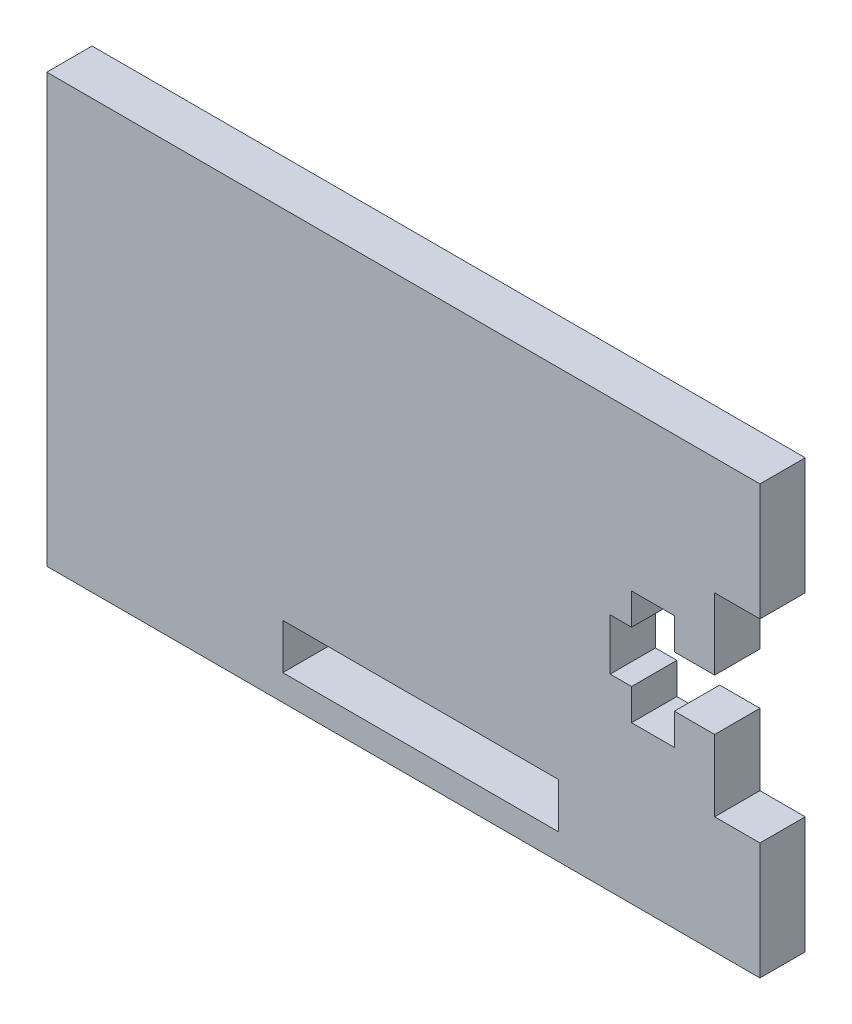
ISO-10303-21;
HEADER;
FILE_DESCRIPTION(('STEP AP214'),'2;1');
FILE_NAME('part.step','',(''),(''),'','','');
FILE_SCHEMA(('AUTOMOTIVE_DESIGN { 1 0 10303 214 1 1 1 1 }'));
ENDSEC;
DATA;
#1=APPLICATION_CONTEXT('core data for automotive mechanical design processes');
#2=APPLICATION_PROTOCOL_DEFINITION('international standard','automotive_design',2000,#1);
#3=PRODUCT_CONTEXT('',#1,'mechanical');
#4=PRODUCT('Part','Part','',(#3));
#5=PRODUCT_RELATED_PRODUCT_CATEGORY('part','',(#4));
#6=PRODUCT_DEFINITION_FORMATION('','',#4);
#7=PRODUCT_DEFINITION_CONTEXT('part definition',#1,'design');
#8=PRODUCT_DEFINITION('design','',#6,#7);
#9=PRODUCT_DEFINITION_SHAPE('','',#8);
#10=(LENGTH_UNIT() NAMED_UNIT(*) SI_UNIT(.MILLI.,.METRE.));
#11=(NAMED_UNIT(*) PLANE_ANGLE_UNIT() SI_UNIT($,.RADIAN.));
#12=(NAMED_UNIT(*) SI_UNIT($,.STERADIAN.) SOLID_ANGLE_UNIT());
#13=UNCERTAINTY_MEASURE_WITH_UNIT(LENGTH_MEASURE(1.E-05),#10,'distance_accuracy_value','');
#14=(GEOMETRIC_REPRESENTATION_CONTEXT(3) GLOBAL_UNCERTAINTY_ASSIGNED_CONTEXT((#13)) GLOBAL_UNIT_ASSIGNED_CONTEXT((#10,
#11,#12)) REPRESENTATION_CONTEXT('',''));
#15=CARTESIAN_POINT('',(0.,0.,0.));
#16=DIRECTION('',(0.,0.,1.));
#17=DIRECTION('',(1.,0.,0.));
#18=AXIS2_PLACEMENT_3D('',#15,#16,#17);
#19=CARTESIAN_POINT('',(0.,0.,3.175));
#20=DIRECTION('',(0.,0.,1.));
#21=DIRECTION('',(1.,0.,0.));
#22=AXIS2_PLACEMENT_3D('',#19,#20,#21);
#23=PLANE('',#22);
#24=DIRECTION('',(0.,-1.,0.));
#25=VECTOR('',#24,1.);
#26=CARTESIAN_POINT('',(-96.9112582031601,47.7807662428294,3.175));
#27=LINE('',#26,#25);
#28=CARTESIAN_POINT('',(-96.9112582031601,47.7807662428294,3.175));
#29=VERTEX_POINT('',#28);
#30=CARTESIAN_POINT('',(-96.9112582031601,17.7807662428356,3.175));
#31=VERTEX_POINT('',#30);
#32=EDGE_CURVE('E230',#29,#31,#27,.T.);
#33=ORIENTED_EDGE('',*,*,#32,.T.);
#34=DIRECTION('',(1.,0.,0.));
#35=VECTOR('',#34,1.);
#36=CARTESIAN_POINT('',(-96.9112582031601,17.7807662428356,3.175));
#37=LINE('',#36,#35);
#38=CARTESIAN_POINT('',(-46.9112582031603,17.7807662428352,3.175));
#39=VERTEX_POINT('',#38);
#40=EDGE_CURVE('E233',#31,#39,#37,.T.);
#41=ORIENTED_EDGE('',*,*,#40,.T.);
#42=DIRECTION('',(0.,1.,0.));
#43=VECTOR('',#42,1.);
#44=CARTESIAN_POINT('',(-46.9112582031603,25.9807662428354,3.175));
#45=LINE('',#44,#43);
#46=CARTESIAN_POINT('',(-46.9112582031603,25.9807662428354,3.175));
#47=VERTEX_POINT('',#46);
#48=EDGE_CURVE('E236',#39,#47,#45,.T.);
#49=ORIENTED_EDGE('',*,*,#48,.T.);
#50=DIRECTION('',(-1.,0.,0.));
#51=VECTOR('',#50,1.);
#52=CARTESIAN_POINT('',(-46.9112582031603,25.9807662428354,3.175));
#53=LINE('',#52,#51);
#54=CARTESIAN_POINT('',(-50.0862582031601,25.9807662428354,3.175));
#55=VERTEX_POINT('',#54);
#56=EDGE_CURVE('E238',#47,#55,#53,.T.);
#57=ORIENTED_EDGE('',*,*,#56,.T.);
#58=DIRECTION('',(0.,1.,0.));
#59=VECTOR('',#58,1.);
#60=CARTESIAN_POINT('',(-50.0862582031601,25.9807662428354,3.175));
#61=LINE('',#60,#59);
#62=CARTESIAN_POINT('',(-50.0862582031601,30.9807662428354,3.175));
#63=VERTEX_POINT('',#62);
#64=EDGE_CURVE('E240',#55,#63,#61,.T.);
#65=ORIENTED_EDGE('',*,*,#64,.T.);
#66=DIRECTION('',(-1.,0.,0.));
#67=VECTOR('',#66,1.);
#68=CARTESIAN_POINT('',(-50.0862582031601,30.9807662428354,3.175));
#69=LINE('',#68,#67);
#70=CARTESIAN_POINT('',(-52.9112582031601,30.9807662428354,3.175));
#71=VERTEX_POINT('',#70);
#72=EDGE_CURVE('E242',#63,#71,#69,.T.);
#73=ORIENTED_EDGE('',*,*,#72,.T.);
#74=DIRECTION('',(0.,-1.,0.));
#75=VECTOR('',#74,1.);
#76=CARTESIAN_POINT('',(-52.9112582031601,30.9807662428354,3.175));
#77=LINE('',#76,#75);
#78=CARTESIAN_POINT('',(-52.9112582031601,28.7807662428356,3.175));
#79=VERTEX_POINT('',#78);
#80=EDGE_CURVE('E244',#71,#79,#77,.T.);
#81=ORIENTED_EDGE('',*,*,#80,.T.);
#82=DIRECTION('',(-1.,0.,0.));
#83=VECTOR('',#82,1.);
#84=CARTESIAN_POINT('',(-52.9112582031601,28.7807662428356,3.175));
#85=LINE('',#84,#83);
#86=CARTESIAN_POINT('',(-55.9112582031601,28.7807662428355,3.175));
#87=VERTEX_POINT('',#86);
#88=EDGE_CURVE('E246',#79,#87,#85,.T.);
#89=ORIENTED_EDGE('',*,*,#88,.T.);
#90=DIRECTION('',(0.,1.,0.));
#91=VECTOR('',#90,1.);
#92=CARTESIAN_POINT('',(-55.9112582031601,28.7807662428355,3.175));
#93=LINE('',#92,#91);
#94=CARTESIAN_POINT('',(-55.9112582031601,30.9807662428356,3.175));
#95=VERTEX_POINT('',#94);
#96=EDGE_CURVE('E248',#87,#95,#93,.T.);
#97=ORIENTED_EDGE('',*,*,#96,.T.);
#98=DIRECTION('',(-1.,0.,0.));
#99=VECTOR('',#98,1.);
#100=CARTESIAN_POINT('',(-55.9112582031601,30.9807662428356,3.175));
#101=LINE('',#100,#99);
#102=CARTESIAN_POINT('',(-57.4112582031601,30.9807662428356,3.175));
#103=VERTEX_POINT('',#102);
#104=EDGE_CURVE('E250',#95,#103,#101,.T.);
#105=ORIENTED_EDGE('',*,*,#104,.T.);
#106=DIRECTION('',(0.,1.,0.));
#107=VECTOR('',#106,1.);
#108=CARTESIAN_POINT('',(-57.4112582031601,34.5807662428356,3.175));
#109=LINE('',#108,#107);
#110=CARTESIAN_POINT('',(-57.4112582031601,34.5807662428356,3.175));
#111=VERTEX_POINT('',#110);
#112=EDGE_CURVE('E252',#103,#111,#109,.T.);
#113=ORIENTED_EDGE('',*,*,#112,.T.);
#114=DIRECTION('',(1.,0.,0.));
#115=VECTOR('',#114,1.);
#116=CARTESIAN_POINT('',(-55.9112582031601,34.5807662428356,3.175));
#117=LINE('',#116,#115);
#118=CARTESIAN_POINT('',(-55.9112582031601,34.5807662428356,3.175));
#119=VERTEX_POINT('',#118);
#120=EDGE_CURVE('E254',#111,#119,#117,.T.);
#121=ORIENTED_EDGE('',*,*,#120,.T.);
#122=DIRECTION('',(0.,1.,0.));
#123=VECTOR('',#122,1.);
#124=CARTESIAN_POINT('',(-55.9112582031601,36.7807662428356,3.175));
#125=LINE('',#124,#123);
#126=CARTESIAN_POINT('',(-55.9112582031601,36.7807662428356,3.175));
#127=VERTEX_POINT('',#126);
#128=EDGE_CURVE('E256',#119,#127,#125,.T.);
#129=ORIENTED_EDGE('',*,*,#128,.T.);
#130=DIRECTION('',(1.,0.,0.));
#131=VECTOR('',#130,1.);
#132=CARTESIAN_POINT('',(-52.9112582031601,36.7807662428356,3.175));
#133=LINE('',#132,#131);
#134=CARTESIAN_POINT('',(-52.9112582031601,36.7807662428356,3.175));
#135=VERTEX_POINT('',#134);
#136=EDGE_CURVE('E258',#127,#135,#133,.T.);
#137=ORIENTED_EDGE('',*,*,#136,.T.);
#138=DIRECTION('',(0.,-1.,0.));
#139=VECTOR('',#138,1.);
#140=CARTESIAN_POINT('',(-52.9112582031601,34.5807662428356,3.175));
#141=LINE('',#140,#139);
#142=CARTESIAN_POINT('',(-52.9112582031601,34.5807662428356,3.175));
#143=VERTEX_POINT('',#142);
#144=EDGE_CURVE('E260',#135,#143,#141,.T.);
#145=ORIENTED_EDGE('',*,*,#144,.T.);
#146=DIRECTION('',(1.,0.,0.));
#147=VECTOR('',#146,1.);
#148=CARTESIAN_POINT('',(-50.0862582031601,34.5807662428356,3.175));
#149=LINE('',#148,#147);
#150=CARTESIAN_POINT('',(-50.0862582031601,34.5807662428356,3.175));
#151=VERTEX_POINT('',#150);
#152=EDGE_CURVE('E262',#143,#151,#149,.T.);
#153=ORIENTED_EDGE('',*,*,#152,.T.);
#154=DIRECTION('',(0.,1.,0.));
#155=VECTOR('',#154,1.);
#156=CARTESIAN_POINT('',(-50.0862582031601,39.5807662428356,3.175));
#157=LINE('',#156,#155);
#158=CARTESIAN_POINT('',(-50.0862582031601,39.5807662428356,3.175));
#159=VERTEX_POINT('',#158);
#160=EDGE_CURVE('E264',#151,#159,#157,.T.);
#161=ORIENTED_EDGE('',*,*,#160,.T.);
#162=DIRECTION('',(1.,0.,0.));
#163=VECTOR('',#162,1.);
#164=CARTESIAN_POINT('',(-46.9112582031603,39.5807662428356,3.175));
#165=LINE('',#164,#163);
#166=CARTESIAN_POINT('',(-46.9112582031603,39.5807662428356,3.175));
#167=VERTEX_POINT('',#166);
#168=EDGE_CURVE('E266',#159,#167,#165,.T.);
#169=ORIENTED_EDGE('',*,*,#168,.T.);
#170=DIRECTION('',(0.,1.,0.));
#171=VECTOR('',#170,1.);
#172=CARTESIAN_POINT('',(-46.9112582031603,47.7807662428294,3.175));
#173=LINE('',#172,#171);
#174=CARTESIAN_POINT('',(-46.9112582031603,47.7807662428294,3.175));
#175=VERTEX_POINT('',#174);
#176=EDGE_CURVE('E268',#167,#175,#173,.T.);
#177=ORIENTED_EDGE('',*,*,#176,.T.);
#178=DIRECTION('',(-1.,0.,0.));
#179=VECTOR('',#178,1.);
#180=CARTESIAN_POINT('',(-96.9112582031601,47.7807662428294,3.175));
#181=LINE('',#180,#179);
#182=EDGE_CURVE('E270',#175,#29,#181,.T.);
#183=ORIENTED_EDGE('',*,*,#182,.T.);
#184=EDGE_LOOP('',(#33,#41,#49,#57,#65,#73,#81,#89,#97,#105,#113,#121,#129,#137,#145,#153,#161,
#169,#177,#183));
#185=FACE_BOUND('',#184,.T.);
#186=DIRECTION('',(-1.,0.,0.));
#187=VECTOR('',#186,1.);
#188=CARTESIAN_POINT('',(-61.0250937078409,22.7702012369483,3.175));
#189=LINE('',#188,#187);
#190=CARTESIAN_POINT('',(-61.0250937078409,22.7702012369483,3.175));
#191=VERTEX_POINT('',#190);
#192=CARTESIAN_POINT('',(-80.3635974839928,22.7702012369483,3.175));
#193=VERTEX_POINT('',#192);
#194=EDGE_CURVE('E202',#191,#193,#189,.T.);
#195=ORIENTED_EDGE('',*,*,#194,.F.);
#196=DIRECTION('',(0.,1.,0.));
#197=VECTOR('',#196,1.);
#198=CARTESIAN_POINT('',(-61.0250937078409,19.5952012369483,3.175));
#199=LINE('',#198,#197);
#200=CARTESIAN_POINT('',(-61.0250937078409,19.5952012369483,3.175));
#201=VERTEX_POINT('',#200);
#202=EDGE_CURVE('E194',#201,#191,#199,.T.);
#203=ORIENTED_EDGE('',*,*,#202,.F.);
#204=DIRECTION('',(1.,0.,0.));
#205=VECTOR('',#204,1.);
#206=CARTESIAN_POINT('',(-61.0250937078409,19.5952012369483,3.175));
#207=LINE('',#206,#205);
#208=CARTESIAN_POINT('',(-80.3635974839928,19.5952012369483,3.175));
#209=VERTEX_POINT('',#208);
#210=EDGE_CURVE('E216',#209,#201,#207,.T.);
#211=ORIENTED_EDGE('',*,*,#210,.F.);
#212=DIRECTION('',(0.,-1.,0.));
#213=VECTOR('',#212,1.);
#214=CARTESIAN_POINT('',(-80.3635974839928,19.5952012369483,3.175));
#215=LINE('',#214,#213);
#216=EDGE_CURVE('E214',#193,#209,#215,.T.);
#217=ORIENTED_EDGE('',*,*,#216,.F.);
#218=EDGE_LOOP('',(#195,#203,#211,#217));
#219=FACE_BOUND('',#218,.T.);
#220=ADVANCED_FACE('F33',(#185,#219),#23,.T.);
#221=CARTESIAN_POINT('',(0.,0.,0.));
#222=DIRECTION('',(0.,0.,1.));
#223=DIRECTION('',(1.,0.,0.));
#224=AXIS2_PLACEMENT_3D('',#221,#222,#223);
#225=PLANE('',#224);
#226=DIRECTION('',(0.,-1.,0.));
#227=VECTOR('',#226,1.);
#228=CARTESIAN_POINT('',(-96.9112582031601,47.7807662428294,0.));
#229=LINE('',#228,#227);
#230=CARTESIAN_POINT('',(-96.9112582031601,47.7807662428294,0.));
#231=VERTEX_POINT('',#230);
#232=CARTESIAN_POINT('',(-96.9112582031601,17.7807662428356,0.));
#233=VERTEX_POINT('',#232);
#234=EDGE_CURVE('E210',#231,#233,#229,.T.);
#235=ORIENTED_EDGE('',*,*,#234,.F.);
#236=DIRECTION('',(-1.,0.,0.));
#237=VECTOR('',#236,1.);
#238=CARTESIAN_POINT('',(-96.9112582031601,47.7807662428294,0.));
#239=LINE('',#238,#237);
#240=CARTESIAN_POINT('',(-46.9112582031603,47.7807662428294,0.));
#241=VERTEX_POINT('',#240);
#242=EDGE_CURVE('E234',#241,#231,#239,.T.);
#243=ORIENTED_EDGE('',*,*,#242,.F.);
#244=DIRECTION('',(0.,1.,0.));
#245=VECTOR('',#244,1.);
#246=CARTESIAN_POINT('',(-46.9112582031603,47.7807662428294,0.));
#247=LINE('',#246,#245);
#248=CARTESIAN_POINT('',(-46.9112582031603,39.5807662428356,0.));
#249=VERTEX_POINT('',#248);
#250=EDGE_CURVE('E309',#249,#241,#247,.T.);
#251=ORIENTED_EDGE('',*,*,#250,.F.);
#252=DIRECTION('',(1.,0.,0.));
#253=VECTOR('',#252,1.);
#254=CARTESIAN_POINT('',(-46.9112582031603,39.5807662428356,0.));
#255=LINE('',#254,#253);
#256=CARTESIAN_POINT('',(-50.0862582031601,39.5807662428356,0.));
#257=VERTEX_POINT('',#256);
#258=EDGE_CURVE('E307',#257,#249,#255,.T.);
#259=ORIENTED_EDGE('',*,*,#258,.F.);
#260=DIRECTION('',(0.,1.,0.));
#261=VECTOR('',#260,1.);
#262=CARTESIAN_POINT('',(-50.0862582031601,39.5807662428356,0.));
#263=LINE('',#262,#261);
#264=CARTESIAN_POINT('',(-50.0862582031601,34.5807662428356,0.));
#265=VERTEX_POINT('',#264);
#266=EDGE_CURVE('E305',#265,#257,#263,.T.);
#267=ORIENTED_EDGE('',*,*,#266,.F.);
#268=DIRECTION('',(1.,0.,0.));
#269=VECTOR('',#268,1.);
#270=CARTESIAN_POINT('',(-50.0862582031601,34.5807662428356,0.));
#271=LINE('',#270,#269);
#272=CARTESIAN_POINT('',(-52.9112582031601,34.5807662428356,0.));
#273=VERTEX_POINT('',#272);
#274=EDGE_CURVE('E303',#273,#265,#271,.T.);
#275=ORIENTED_EDGE('',*,*,#274,.F.);
#276=DIRECTION('',(0.,-1.,0.));
#277=VECTOR('',#276,1.);
#278=CARTESIAN_POINT('',(-52.9112582031601,34.5807662428356,0.));
#279=LINE('',#278,#277);
#280=CARTESIAN_POINT('',(-52.9112582031601,36.7807662428356,0.));
#281=VERTEX_POINT('',#280);
#282=EDGE_CURVE('E301',#281,#273,#279,.T.);
#283=ORIENTED_EDGE('',*,*,#282,.F.);
#284=DIRECTION('',(1.,0.,0.));
#285=VECTOR('',#284,1.);
#286=CARTESIAN_POINT('',(-52.9112582031601,36.7807662428356,0.));
#287=LINE('',#286,#285);
#288=CARTESIAN_POINT('',(-55.9112582031601,36.7807662428356,0.));
#289=VERTEX_POINT('',#288);
#290=EDGE_CURVE('E299',#289,#281,#287,.T.);
#291=ORIENTED_EDGE('',*,*,#290,.F.);
#292=DIRECTION('',(0.,1.,0.));
#293=VECTOR('',#292,1.);
#294=CARTESIAN_POINT('',(-55.9112582031601,36.7807662428356,0.));
#295=LINE('',#294,#293);
#296=CARTESIAN_POINT('',(-55.9112582031601,34.5807662428356,0.));
#297=VERTEX_POINT('',#296);
#298=EDGE_CURVE('E297',#297,#289,#295,.T.);
#299=ORIENTED_EDGE('',*,*,#298,.F.);
#300=DIRECTION('',(1.,0.,0.));
#301=VECTOR('',#300,1.);
#302=CARTESIAN_POINT('',(-55.9112582031601,34.5807662428356,0.));
#303=LINE('',#302,#301);
#304=CARTESIAN_POINT('',(-57.4112582031601,34.5807662428356,0.));
#305=VERTEX_POINT('',#304);
#306=EDGE_CURVE('E295',#305,#297,#303,.T.);
#307=ORIENTED_EDGE('',*,*,#306,.F.);
#308=DIRECTION('',(0.,1.,0.));
#309=VECTOR('',#308,1.);
#310=CARTESIAN_POINT('',(-57.4112582031601,34.5807662428356,0.));
#311=LINE('',#310,#309);
#312=CARTESIAN_POINT('',(-57.4112582031601,30.9807662428356,0.));
#313=VERTEX_POINT('',#312);
#314=EDGE_CURVE('E293',#313,#305,#311,.T.);
#315=ORIENTED_EDGE('',*,*,#314,.F.);
#316=DIRECTION('',(-1.,0.,0.));
#317=VECTOR('',#316,1.);
#318=CARTESIAN_POINT('',(-55.9112582031601,30.9807662428356,0.));
#319=LINE('',#318,#317);
#320=CARTESIAN_POINT('',(-55.9112582031601,30.9807662428356,0.));
#321=VERTEX_POINT('',#320);
#322=EDGE_CURVE('E291',#321,#313,#319,.T.);
#323=ORIENTED_EDGE('',*,*,#322,.F.);
#324=DIRECTION('',(0.,1.,0.));
#325=VECTOR('',#324,1.);
#326=CARTESIAN_POINT('',(-55.9112582031601,28.7807662428355,0.));
#327=LINE('',#326,#325);
#328=CARTESIAN_POINT('',(-55.9112582031601,28.7807662428355,0.));
#329=VERTEX_POINT('',#328);
#330=EDGE_CURVE('E289',#329,#321,#327,.T.);
#331=ORIENTED_EDGE('',*,*,#330,.F.);
#332=DIRECTION('',(-1.,0.,0.));
#333=VECTOR('',#332,1.);
#334=CARTESIAN_POINT('',(-52.9112582031601,28.7807662428356,0.));
#335=LINE('',#334,#333);
#336=CARTESIAN_POINT('',(-52.9112582031601,28.7807662428356,0.));
#337=VERTEX_POINT('',#336);
#338=EDGE_CURVE('E287',#337,#329,#335,.T.);
#339=ORIENTED_EDGE('',*,*,#338,.F.);
#340=DIRECTION('',(0.,-1.,0.));
#341=VECTOR('',#340,1.);
#342=CARTESIAN_POINT('',(-52.9112582031601,30.9807662428354,0.));
#343=LINE('',#342,#341);
#344=CARTESIAN_POINT('',(-52.9112582031601,30.9807662428354,0.));
#345=VERTEX_POINT('',#344);
#346=EDGE_CURVE('E285',#345,#337,#343,.T.);
#347=ORIENTED_EDGE('',*,*,#346,.F.);
#348=DIRECTION('',(-1.,0.,0.));
#349=VECTOR('',#348,1.);
#350=CARTESIAN_POINT('',(-50.0862582031601,30.9807662428354,0.));
#351=LINE('',#350,#349);
#352=CARTESIAN_POINT('',(-50.0862582031601,30.9807662428354,0.));
#353=VERTEX_POINT('',#352);
#354=EDGE_CURVE('E283',#353,#345,#351,.T.);
#355=ORIENTED_EDGE('',*,*,#354,.F.);
#356=DIRECTION('',(0.,1.,0.));
#357=VECTOR('',#356,1.);
#358=CARTESIAN_POINT('',(-50.0862582031601,25.9807662428354,0.));
#359=LINE('',#358,#357);
#360=CARTESIAN_POINT('',(-50.0862582031601,25.9807662428354,0.));
#361=VERTEX_POINT('',#360);
#362=EDGE_CURVE('E281',#361,#353,#359,.T.);
#363=ORIENTED_EDGE('',*,*,#362,.F.);
#364=DIRECTION('',(-1.,0.,0.));
#365=VECTOR('',#364,1.);
#366=CARTESIAN_POINT('',(-46.9112582031603,25.9807662428354,0.));
#367=LINE('',#366,#365);
#368=CARTESIAN_POINT('',(-46.9112582031603,25.9807662428354,0.));
#369=VERTEX_POINT('',#368);
#370=EDGE_CURVE('E279',#369,#361,#367,.T.);
#371=ORIENTED_EDGE('',*,*,#370,.F.);
#372=DIRECTION('',(0.,1.,0.));
#373=VECTOR('',#372,1.);
#374=CARTESIAN_POINT('',(-46.9112582031603,25.9807662428354,0.));
#375=LINE('',#374,#373);
#376=CARTESIAN_POINT('',(-46.9112582031603,17.7807662428352,0.));
#377=VERTEX_POINT('',#376);
#378=EDGE_CURVE('E277',#377,#369,#375,.T.);
#379=ORIENTED_EDGE('',*,*,#378,.F.);
#380=DIRECTION('',(1.,0.,0.));
#381=VECTOR('',#380,1.);
#382=CARTESIAN_POINT('',(-96.9112582031601,17.7807662428356,0.));
#383=LINE('',#382,#381);
#384=EDGE_CURVE('E275',#233,#377,#383,.T.);
#385=ORIENTED_EDGE('',*,*,#384,.F.);
#386=EDGE_LOOP('',(#235,#243,#251,#259,#267,#275,#283,#291,#299,#307,#315,#323,#331,#339,#347,
#355,#363,#371,#379,#385));
#387=FACE_BOUND('',#386,.T.);
#388=DIRECTION('',(0.,1.,0.));
#389=VECTOR('',#388,1.);
#390=CARTESIAN_POINT('',(-61.0250937078409,19.5952012369483,0.));
#391=LINE('',#390,#389);
#392=CARTESIAN_POINT('',(-61.0250937078409,19.5952012369483,0.));
#393=VERTEX_POINT('',#392);
#394=CARTESIAN_POINT('',(-61.0250937078409,22.7702012369483,0.));
#395=VERTEX_POINT('',#394);
#396=EDGE_CURVE('E56',#393,#395,#391,.T.);
#397=ORIENTED_EDGE('',*,*,#396,.T.);
#398=DIRECTION('',(-1.,0.,0.));
#399=VECTOR('',#398,1.);
#400=CARTESIAN_POINT('',(-61.0250937078409,22.7702012369483,0.));
#401=LINE('',#400,#399);
#402=CARTESIAN_POINT('',(-80.3635974839928,22.7702012369483,0.));
#403=VERTEX_POINT('',#402);
#404=EDGE_CURVE('E209',#395,#403,#401,.T.);
#405=ORIENTED_EDGE('',*,*,#404,.T.);
#406=DIRECTION('',(0.,-1.,0.));
#407=VECTOR('',#406,1.);
#408=CARTESIAN_POINT('',(-80.3635974839928,19.5952012369483,0.));
#409=LINE('',#408,#407);
#410=CARTESIAN_POINT('',(-80.3635974839928,19.5952012369483,0.));
#411=VERTEX_POINT('',#410);
#412=EDGE_CURVE('E222',#403,#411,#409,.T.);
#413=ORIENTED_EDGE('',*,*,#412,.T.);
#414=DIRECTION('',(1.,0.,0.));
#415=VECTOR('',#414,1.);
#416=CARTESIAN_POINT('',(-61.0250937078409,19.5952012369483,0.));
#417=LINE('',#416,#415);
#418=EDGE_CURVE('E203',#411,#393,#417,.T.);
#419=ORIENTED_EDGE('',*,*,#418,.T.);
#420=EDGE_LOOP('',(#397,#405,#413,#419));
#421=FACE_BOUND('',#420,.T.);
#422=ADVANCED_FACE('F375',(#387,#421),#225,.F.);
#423=CARTESIAN_POINT('',(-96.9112582031601,47.7807662428294,3.175));
#424=DIRECTION('',(1.,0.,0.));
#425=DIRECTION('',(0.,0.,-1.));
#426=AXIS2_PLACEMENT_3D('',#423,#424,#425);
#427=PLANE('',#426);
#428=ORIENTED_EDGE('',*,*,#234,.T.);
#429=DIRECTION('',(0.,0.,-1.));
#430=VECTOR('',#429,1.);
#431=CARTESIAN_POINT('',(-96.9112582031601,17.7807662428356,3.175));
#432=LINE('',#431,#430);
#433=EDGE_CURVE('E11',#31,#233,#432,.T.);
#434=ORIENTED_EDGE('',*,*,#433,.F.);
#435=ORIENTED_EDGE('',*,*,#32,.F.);
#436=DIRECTION('',(0.,0.,-1.));
#437=VECTOR('',#436,1.);
#438=CARTESIAN_POINT('',(-96.9112582031601,47.7807662428294,3.175));
#439=LINE('',#438,#437);
#440=EDGE_CURVE('E272',#29,#231,#439,.T.);
#441=ORIENTED_EDGE('',*,*,#440,.T.);
#442=EDGE_LOOP('',(#428,#434,#435,#441));
#443=FACE_BOUND('',#442,.T.);
#444=ADVANCED_FACE('F35',(#443),#427,.F.);
#445=CARTESIAN_POINT('',(-96.9112582031601,17.7807662428356,3.175));
#446=DIRECTION('',(0.,1.,0.));
#447=DIRECTION('',(-1.,0.,0.));
#448=AXIS2_PLACEMENT_3D('',#445,#446,#447);
#449=PLANE('',#448);
#450=ORIENTED_EDGE('',*,*,#384,.T.);
#451=DIRECTION('',(0.,0.,-1.));
#452=VECTOR('',#451,1.);
#453=CARTESIAN_POINT('',(-46.9112582031603,17.7807662428352,3.175));
#454=LINE('',#453,#452);
#455=EDGE_CURVE('E41',#39,#377,#454,.T.);
#456=ORIENTED_EDGE('',*,*,#455,.F.);
#457=ORIENTED_EDGE('',*,*,#40,.F.);
#458=ORIENTED_EDGE('',*,*,#433,.T.);
#459=EDGE_LOOP('',(#450,#456,#457,#458));
#460=FACE_BOUND('',#459,.T.);
#461=ADVANCED_FACE('F392',(#460),#449,.F.);
#462=CARTESIAN_POINT('',(-46.9112582031603,25.9807662428354,3.175));
#463=DIRECTION('',(-1.,0.,0.));
#464=DIRECTION('',(0.,0.,1.));
#465=AXIS2_PLACEMENT_3D('',#462,#463,#464);
#466=PLANE('',#465);
#467=ORIENTED_EDGE('',*,*,#378,.T.);
#468=DIRECTION('',(0.,0.,-1.));
#469=VECTOR('',#468,1.);
#470=CARTESIAN_POINT('',(-46.9112582031603,25.9807662428354,3.175));
#471=LINE('',#470,#469);
#472=EDGE_CURVE('E362',#47,#369,#471,.T.);
#473=ORIENTED_EDGE('',*,*,#472,.F.);
#474=ORIENTED_EDGE('',*,*,#48,.F.);
#475=ORIENTED_EDGE('',*,*,#455,.T.);
#476=EDGE_LOOP('',(#467,#473,#474,#475));
#477=FACE_BOUND('',#476,.T.);
#478=ADVANCED_FACE('F369',(#477),#466,.F.);
#479=CARTESIAN_POINT('',(-46.9112582031603,25.9807662428354,3.175));
#480=DIRECTION('',(0.,-1.,0.));
#481=DIRECTION('',(1.,0.,0.));
#482=AXIS2_PLACEMENT_3D('',#479,#480,#481);
#483=PLANE('',#482);
#484=ORIENTED_EDGE('',*,*,#370,.T.);
#485=DIRECTION('',(0.,0.,-1.));
#486=VECTOR('',#485,1.);
#487=CARTESIAN_POINT('',(-50.0862582031601,25.9807662428354,3.175));
#488=LINE('',#487,#486);
#489=EDGE_CURVE('E359',#55,#361,#488,.T.);
#490=ORIENTED_EDGE('',*,*,#489,.F.);
#491=ORIENTED_EDGE('',*,*,#56,.F.);
#492=ORIENTED_EDGE('',*,*,#472,.T.);
#493=EDGE_LOOP('',(#484,#490,#491,#492));
#494=FACE_BOUND('',#493,.T.);
#495=ADVANCED_FACE('F381',(#494),#483,.F.);
#496=CARTESIAN_POINT('',(-50.0862582031601,25.9807662428354,3.175));
#497=DIRECTION('',(-1.,0.,0.));
#498=DIRECTION('',(0.,-1.,0.));
#499=AXIS2_PLACEMENT_3D('',#496,#497,#498);
#500=PLANE('',#499);
#501=ORIENTED_EDGE('',*,*,#362,.T.);
#502=DIRECTION('',(0.,0.,-1.));
#503=VECTOR('',#502,1.);
#504=CARTESIAN_POINT('',(-50.0862582031601,30.9807662428354,3.175));
#505=LINE('',#504,#503);
#506=EDGE_CURVE('E356',#63,#353,#505,.T.);
#507=ORIENTED_EDGE('',*,*,#506,.F.);
#508=ORIENTED_EDGE('',*,*,#64,.F.);
#509=ORIENTED_EDGE('',*,*,#489,.T.);
#510=EDGE_LOOP('',(#501,#507,#508,#509));
#511=FACE_BOUND('',#510,.T.);
#512=ADVANCED_FACE('F385',(#511),#500,.F.);
#513=CARTESIAN_POINT('',(-50.0862582031601,30.9807662428354,3.175));
#514=DIRECTION('',(0.,-1.,0.));
#515=DIRECTION('',(1.,0.,0.));
#516=AXIS2_PLACEMENT_3D('',#513,#514,#515);
#517=PLANE('',#516);
#518=ORIENTED_EDGE('',*,*,#354,.T.);
#519=DIRECTION('',(0.,0.,-1.));
#520=VECTOR('',#519,1.);
#521=CARTESIAN_POINT('',(-52.9112582031601,30.9807662428354,3.175));
#522=LINE('',#521,#520);
#523=EDGE_CURVE('E353',#71,#345,#522,.T.);
#524=ORIENTED_EDGE('',*,*,#523,.F.);
#525=ORIENTED_EDGE('',*,*,#72,.F.);
#526=ORIENTED_EDGE('',*,*,#506,.T.);
#527=EDGE_LOOP('',(#518,#524,#525,#526));
#528=FACE_BOUND('',#527,.T.);
#529=ADVANCED_FACE('F465',(#528),#517,.F.);
#530=CARTESIAN_POINT('',(-52.9112582031601,30.9807662428354,3.175));
#531=DIRECTION('',(1.,0.,0.));
#532=DIRECTION('',(0.,0.,-1.));
#533=AXIS2_PLACEMENT_3D('',#530,#531,#532);
#534=PLANE('',#533);
#535=ORIENTED_EDGE('',*,*,#346,.T.);
#536=DIRECTION('',(0.,0.,-1.));
#537=VECTOR('',#536,1.);
#538=CARTESIAN_POINT('',(-52.9112582031601,28.7807662428356,3.175));
#539=LINE('',#538,#537);
#540=EDGE_CURVE('E350',#79,#337,#539,.T.);
#541=ORIENTED_EDGE('',*,*,#540,.F.);
#542=ORIENTED_EDGE('',*,*,#80,.F.);
#543=ORIENTED_EDGE('',*,*,#523,.T.);
#544=EDGE_LOOP('',(#535,#541,#542,#543));
#545=FACE_BOUND('',#544,.T.);
#546=ADVANCED_FACE('F463',(#545),#534,.F.);
#547=CARTESIAN_POINT('',(-52.9112582031601,28.7807662428356,3.175));
#548=DIRECTION('',(0.,-1.,0.));
#549=DIRECTION('',(1.,0.,0.));
#550=AXIS2_PLACEMENT_3D('',#547,#548,#549);
#551=PLANE('',#550);
#552=ORIENTED_EDGE('',*,*,#338,.T.);
#553=DIRECTION('',(0.,0.,-1.));
#554=VECTOR('',#553,1.);
#555=CARTESIAN_POINT('',(-55.9112582031601,28.7807662428355,3.175));
#556=LINE('',#555,#554);
#557=EDGE_CURVE('E347',#87,#329,#556,.T.);
#558=ORIENTED_EDGE('',*,*,#557,.F.);
#559=ORIENTED_EDGE('',*,*,#88,.F.);
#560=ORIENTED_EDGE('',*,*,#540,.T.);
#561=EDGE_LOOP('',(#552,#558,#559,#560));
#562=FACE_BOUND('',#561,.T.);
#563=ADVANCED_FACE('F458',(#562),#551,.F.);
#564=CARTESIAN_POINT('',(-55.9112582031601,28.7807662428355,3.175));
#565=DIRECTION('',(-1.,0.,0.));
#566=DIRECTION('',(0.,0.,1.));
#567=AXIS2_PLACEMENT_3D('',#564,#565,#566);
#568=PLANE('',#567);
#569=ORIENTED_EDGE('',*,*,#330,.T.);
#570=DIRECTION('',(0.,0.,-1.));
#571=VECTOR('',#570,1.);
#572=CARTESIAN_POINT('',(-55.9112582031601,30.9807662428356,3.175));
#573=LINE('',#572,#571);
#574=EDGE_CURVE('E344',#95,#321,#573,.T.);
#575=ORIENTED_EDGE('',*,*,#574,.F.);
#576=ORIENTED_EDGE('',*,*,#96,.F.);
#577=ORIENTED_EDGE('',*,*,#557,.T.);
#578=EDGE_LOOP('',(#569,#575,#576,#577));
#579=FACE_BOUND('',#578,.T.);
#580=ADVANCED_FACE('F453',(#579),#568,.F.);
#581=CARTESIAN_POINT('',(-55.9112582031601,30.9807662428356,3.175));
#582=DIRECTION('',(0.,-1.,0.));
#583=DIRECTION('',(1.,0.,0.));
#584=AXIS2_PLACEMENT_3D('',#581,#582,#583);
#585=PLANE('',#584);
#586=ORIENTED_EDGE('',*,*,#322,.T.);
#587=DIRECTION('',(0.,0.,-1.));
#588=VECTOR('',#587,1.);
#589=CARTESIAN_POINT('',(-57.4112582031601,30.9807662428356,3.175));
#590=LINE('',#589,#588);
#591=EDGE_CURVE('E341',#103,#313,#590,.T.);
#592=ORIENTED_EDGE('',*,*,#591,.F.);
#593=ORIENTED_EDGE('',*,*,#104,.F.);
#594=ORIENTED_EDGE('',*,*,#574,.T.);
#595=EDGE_LOOP('',(#586,#592,#593,#594));
#596=FACE_BOUND('',#595,.T.);
#597=ADVANCED_FACE('F449',(#596),#585,.F.);
#598=CARTESIAN_POINT('',(-57.4112582031601,34.5807662428356,3.175));
#599=DIRECTION('',(-1.,0.,0.));
#600=DIRECTION('',(0.,0.,1.));
#601=AXIS2_PLACEMENT_3D('',#598,#599,#600);
#602=PLANE('',#601);
#603=ORIENTED_EDGE('',*,*,#314,.T.);
#604=DIRECTION('',(0.,0.,-1.));
#605=VECTOR('',#604,1.);
#606=CARTESIAN_POINT('',(-57.4112582031601,34.5807662428356,3.175));
#607=LINE('',#606,#605);
#608=EDGE_CURVE('E338',#111,#305,#607,.T.);
#609=ORIENTED_EDGE('',*,*,#608,.F.);
#610=ORIENTED_EDGE('',*,*,#112,.F.);
#611=ORIENTED_EDGE('',*,*,#591,.T.);
#612=EDGE_LOOP('',(#603,#609,#610,#611));
#613=FACE_BOUND('',#612,.T.);
#614=ADVANCED_FACE('F444',(#613),#602,.F.);
#615=CARTESIAN_POINT('',(-55.9112582031601,34.5807662428356,3.175));
#616=DIRECTION('',(0.,1.,0.));
#617=DIRECTION('',(0.,0.,1.));
#618=AXIS2_PLACEMENT_3D('',#615,#616,#617);
#619=PLANE('',#618);
#620=ORIENTED_EDGE('',*,*,#306,.T.);
#621=DIRECTION('',(0.,0.,-1.));
#622=VECTOR('',#621,1.);
#623=CARTESIAN_POINT('',(-55.9112582031601,34.5807662428356,3.175));
#624=LINE('',#623,#622);
#625=EDGE_CURVE('E335',#119,#297,#624,.T.);
#626=ORIENTED_EDGE('',*,*,#625,.F.);
#627=ORIENTED_EDGE('',*,*,#120,.F.);
#628=ORIENTED_EDGE('',*,*,#608,.T.);
#629=EDGE_LOOP('',(#620,#626,#627,#628));
#630=FACE_BOUND('',#629,.T.);
#631=ADVANCED_FACE('F438',(#630),#619,.F.);
#632=CARTESIAN_POINT('',(-55.9112582031601,36.7807662428356,3.175));
#633=DIRECTION('',(-1.,0.,0.));
#634=DIRECTION('',(0.,0.,1.));
#635=AXIS2_PLACEMENT_3D('',#632,#633,#634);
#636=PLANE('',#635);
#637=ORIENTED_EDGE('',*,*,#298,.T.);
#638=DIRECTION('',(0.,0.,-1.));
#639=VECTOR('',#638,1.);
#640=CARTESIAN_POINT('',(-55.9112582031601,36.7807662428356,3.175));
#641=LINE('',#640,#639);
#642=EDGE_CURVE('E332',#127,#289,#641,.T.);
#643=ORIENTED_EDGE('',*,*,#642,.F.);
#644=ORIENTED_EDGE('',*,*,#128,.F.);
#645=ORIENTED_EDGE('',*,*,#625,.T.);
#646=EDGE_LOOP('',(#637,#643,#644,#645));
#647=FACE_BOUND('',#646,.T.);
#648=ADVANCED_FACE('F434',(#647),#636,.F.);
#649=CARTESIAN_POINT('',(-52.9112582031601,36.7807662428356,3.175));
#650=DIRECTION('',(0.,1.,0.));
#651=DIRECTION('',(0.,0.,1.));
#652=AXIS2_PLACEMENT_3D('',#649,#650,#651);
#653=PLANE('',#652);
#654=ORIENTED_EDGE('',*,*,#290,.T.);
#655=DIRECTION('',(0.,0.,-1.));
#656=VECTOR('',#655,1.);
#657=CARTESIAN_POINT('',(-52.9112582031601,36.7807662428356,3.175));
#658=LINE('',#657,#656);
#659=EDGE_CURVE('E329',#135,#281,#658,.T.);
#660=ORIENTED_EDGE('',*,*,#659,.F.);
#661=ORIENTED_EDGE('',*,*,#136,.F.);
#662=ORIENTED_EDGE('',*,*,#642,.T.);
#663=EDGE_LOOP('',(#654,#660,#661,#662));
#664=FACE_BOUND('',#663,.T.);
#665=ADVANCED_FACE('F429',(#664),#653,.F.);
#666=CARTESIAN_POINT('',(-52.9112582031601,34.5807662428356,3.175));
#667=DIRECTION('',(1.,0.,0.));
#668=DIRECTION('',(0.,0.,-1.));
#669=AXIS2_PLACEMENT_3D('',#666,#667,#668);
#670=PLANE('',#669);
#671=ORIENTED_EDGE('',*,*,#282,.T.);
#672=DIRECTION('',(0.,0.,-1.));
#673=VECTOR('',#672,1.);
#674=CARTESIAN_POINT('',(-52.9112582031601,34.5807662428356,3.175));
#675=LINE('',#674,#673);
#676=EDGE_CURVE('E326',#143,#273,#675,.T.);
#677=ORIENTED_EDGE('',*,*,#676,.F.);
#678=ORIENTED_EDGE('',*,*,#144,.F.);
#679=ORIENTED_EDGE('',*,*,#659,.T.);
#680=EDGE_LOOP('',(#671,#677,#678,#679));
#681=FACE_BOUND('',#680,.T.);
#682=ADVANCED_FACE('F423',(#681),#670,.F.);
#683=CARTESIAN_POINT('',(-50.0862582031601,34.5807662428356,3.175));
#684=DIRECTION('',(0.,1.,0.));
#685=DIRECTION('',(0.,0.,1.));
#686=AXIS2_PLACEMENT_3D('',#683,#684,#685);
#687=PLANE('',#686);
#688=ORIENTED_EDGE('',*,*,#274,.T.);
#689=DIRECTION('',(0.,0.,-1.));
#690=VECTOR('',#689,1.);
#691=CARTESIAN_POINT('',(-50.0862582031601,34.5807662428356,3.175));
#692=LINE('',#691,#690);
#693=EDGE_CURVE('E323',#151,#265,#692,.T.);
#694=ORIENTED_EDGE('',*,*,#693,.F.);
#695=ORIENTED_EDGE('',*,*,#152,.F.);
#696=ORIENTED_EDGE('',*,*,#676,.T.);
#697=EDGE_LOOP('',(#688,#694,#695,#696));
#698=FACE_BOUND('',#697,.T.);
#699=ADVANCED_FACE('F419',(#698),#687,.F.);
#700=CARTESIAN_POINT('',(-50.0862582031601,39.5807662428356,3.175));
#701=DIRECTION('',(-1.,0.,0.));
#702=DIRECTION('',(0.,0.,1.));
#703=AXIS2_PLACEMENT_3D('',#700,#701,#702);
#704=PLANE('',#703);
#705=ORIENTED_EDGE('',*,*,#266,.T.);
#706=DIRECTION('',(0.,0.,-1.));
#707=VECTOR('',#706,1.);
#708=CARTESIAN_POINT('',(-50.0862582031601,39.5807662428356,3.175));
#709=LINE('',#708,#707);
#710=EDGE_CURVE('E320',#159,#257,#709,.T.);
#711=ORIENTED_EDGE('',*,*,#710,.F.);
#712=ORIENTED_EDGE('',*,*,#160,.F.);
#713=ORIENTED_EDGE('',*,*,#693,.T.);
#714=EDGE_LOOP('',(#705,#711,#712,#713));
#715=FACE_BOUND('',#714,.T.);
#716=ADVANCED_FACE('F414',(#715),#704,.F.);
#717=CARTESIAN_POINT('',(-46.9112582031603,39.5807662428356,3.175));
#718=DIRECTION('',(0.,1.,0.));
#719=DIRECTION('',(0.,0.,1.));
#720=AXIS2_PLACEMENT_3D('',#717,#718,#719);
#721=PLANE('',#720);
#722=ORIENTED_EDGE('',*,*,#258,.T.);
#723=DIRECTION('',(0.,0.,-1.));
#724=VECTOR('',#723,1.);
#725=CARTESIAN_POINT('',(-46.9112582031603,39.5807662428356,3.175));
#726=LINE('',#725,#724);
#727=EDGE_CURVE('E317',#167,#249,#726,.T.);
#728=ORIENTED_EDGE('',*,*,#727,.F.);
#729=ORIENTED_EDGE('',*,*,#168,.F.);
#730=ORIENTED_EDGE('',*,*,#710,.T.);
#731=EDGE_LOOP('',(#722,#728,#729,#730));
#732=FACE_BOUND('',#731,.T.);
#733=ADVANCED_FACE('F408',(#732),#721,.F.);
#734=CARTESIAN_POINT('',(-46.9112582031603,47.7807662428294,3.175));
#735=DIRECTION('',(-1.,0.,0.));
#736=DIRECTION('',(0.,-1.,0.));
#737=AXIS2_PLACEMENT_3D('',#734,#735,#736);
#738=PLANE('',#737);
#739=ORIENTED_EDGE('',*,*,#250,.T.);
#740=DIRECTION('',(0.,0.,-1.));
#741=VECTOR('',#740,1.);
#742=CARTESIAN_POINT('',(-46.9112582031603,47.7807662428294,3.175));
#743=LINE('',#742,#741);
#744=EDGE_CURVE('E314',#175,#241,#743,.T.);
#745=ORIENTED_EDGE('',*,*,#744,.F.);
#746=ORIENTED_EDGE('',*,*,#176,.F.);
#747=ORIENTED_EDGE('',*,*,#727,.T.);
#748=EDGE_LOOP('',(#739,#745,#746,#747));
#749=FACE_BOUND('',#748,.T.);
#750=ADVANCED_FACE('F404',(#749),#738,.F.);
#751=CARTESIAN_POINT('',(-96.9112582031601,47.7807662428294,3.175));
#752=DIRECTION('',(0.,-1.,0.));
#753=DIRECTION('',(1.,0.,0.));
#754=AXIS2_PLACEMENT_3D('',#751,#752,#753);
#755=PLANE('',#754);
#756=ORIENTED_EDGE('',*,*,#242,.T.);
#757=ORIENTED_EDGE('',*,*,#440,.F.);
#758=ORIENTED_EDGE('',*,*,#182,.F.);
#759=ORIENTED_EDGE('',*,*,#744,.T.);
#760=EDGE_LOOP('',(#756,#757,#758,#759));
#761=FACE_BOUND('',#760,.T.);
#762=ADVANCED_FACE('F399',(#761),#755,.F.);
#763=CARTESIAN_POINT('',(-61.0250937078409,19.5952012369483,3.175));
#764=DIRECTION('',(-1.,0.,0.));
#765=DIRECTION('',(0.,0.,1.));
#766=AXIS2_PLACEMENT_3D('',#763,#764,#765);
#767=PLANE('',#766);
#768=ORIENTED_EDGE('',*,*,#396,.F.);
#769=DIRECTION('',(0.,0.,-1.));
#770=VECTOR('',#769,1.);
#771=CARTESIAN_POINT('',(-61.0250937078409,19.5952012369483,3.175));
#772=LINE('',#771,#770);
#773=EDGE_CURVE('E198',#201,#393,#772,.T.);
#774=ORIENTED_EDGE('',*,*,#773,.F.);
#775=ORIENTED_EDGE('',*,*,#202,.T.);
#776=DIRECTION('',(0.,0.,-1.));
#777=VECTOR('',#776,1.);
#778=CARTESIAN_POINT('',(-61.0250937078409,22.7702012369483,3.175));
#779=LINE('',#778,#777);
#780=EDGE_CURVE('E197',#191,#395,#779,.T.);
#781=ORIENTED_EDGE('',*,*,#780,.T.);
#782=EDGE_LOOP('',(#768,#774,#775,#781));
#783=FACE_BOUND('',#782,.T.);
#784=ADVANCED_FACE('F196',(#783),#767,.T.);
#785=CARTESIAN_POINT('',(-61.0250937078409,22.7702012369483,3.175));
#786=DIRECTION('',(0.,-1.,0.));
#787=DIRECTION('',(1.,0.,0.));
#788=AXIS2_PLACEMENT_3D('',#785,#786,#787);
#789=PLANE('',#788);
#790=ORIENTED_EDGE('',*,*,#404,.F.);
#791=ORIENTED_EDGE('',*,*,#780,.F.);
#792=ORIENTED_EDGE('',*,*,#194,.T.);
#793=DIRECTION('',(0.,0.,-1.));
#794=VECTOR('',#793,1.);
#795=CARTESIAN_POINT('',(-80.3635974839928,22.7702012369483,3.175));
#796=LINE('',#795,#794);
#797=EDGE_CURVE('E211',#193,#403,#796,.T.);
#798=ORIENTED_EDGE('',*,*,#797,.T.);
#799=EDGE_LOOP('',(#790,#791,#792,#798));
#800=FACE_BOUND('',#799,.T.);
#801=ADVANCED_FACE('F206',(#800),#789,.T.);
#802=CARTESIAN_POINT('',(-80.3635974839928,19.5952012369483,3.175));
#803=DIRECTION('',(1.,0.,0.));
#804=DIRECTION('',(0.,0.,-1.));
#805=AXIS2_PLACEMENT_3D('',#802,#803,#804);
#806=PLANE('',#805);
#807=ORIENTED_EDGE('',*,*,#412,.F.);
#808=ORIENTED_EDGE('',*,*,#797,.F.);
#809=ORIENTED_EDGE('',*,*,#216,.T.);
#810=DIRECTION('',(0.,0.,-1.));
#811=VECTOR('',#810,1.);
#812=CARTESIAN_POINT('',(-80.3635974839928,19.5952012369483,3.175));
#813=LINE('',#812,#811);
#814=EDGE_CURVE('E48',#209,#411,#813,.T.);
#815=ORIENTED_EDGE('',*,*,#814,.T.);
#816=EDGE_LOOP('',(#807,#808,#809,#815));
#817=FACE_BOUND('',#816,.T.);
#818=ADVANCED_FACE('F571',(#817),#806,.T.);
#819=CARTESIAN_POINT('',(-61.0250937078409,19.5952012369483,3.175));
#820=DIRECTION('',(0.,1.,0.));
#821=DIRECTION('',(0.,0.,1.));
#822=AXIS2_PLACEMENT_3D('',#819,#820,#821);
#823=PLANE('',#822);
#824=ORIENTED_EDGE('',*,*,#418,.F.);
#825=ORIENTED_EDGE('',*,*,#814,.F.);
#826=ORIENTED_EDGE('',*,*,#210,.T.);
#827=ORIENTED_EDGE('',*,*,#773,.T.);
#828=EDGE_LOOP('',(#824,#825,#826,#827));
#829=FACE_BOUND('',#828,.T.);
#830=ADVANCED_FACE('F577',(#829),#823,.T.);
#831=CLOSED_SHELL('',(#220,#422,#444,#461,#478,#495,#512,#529,#546,#563,#580,#597,#614,#631,
#648,#665,#682,#699,#716,#733,#750,#762,#784,#801,#818,#830));
#832=MANIFOLD_SOLID_BREP('B2',#831);
#833=ADVANCED_BREP_SHAPE_REPRESENTATION('',(#18,#832),#14);
#834=SHAPE_DEFINITION_REPRESENTATION(#9,#833);
ENDSEC;
END-ISO-10303-21;
